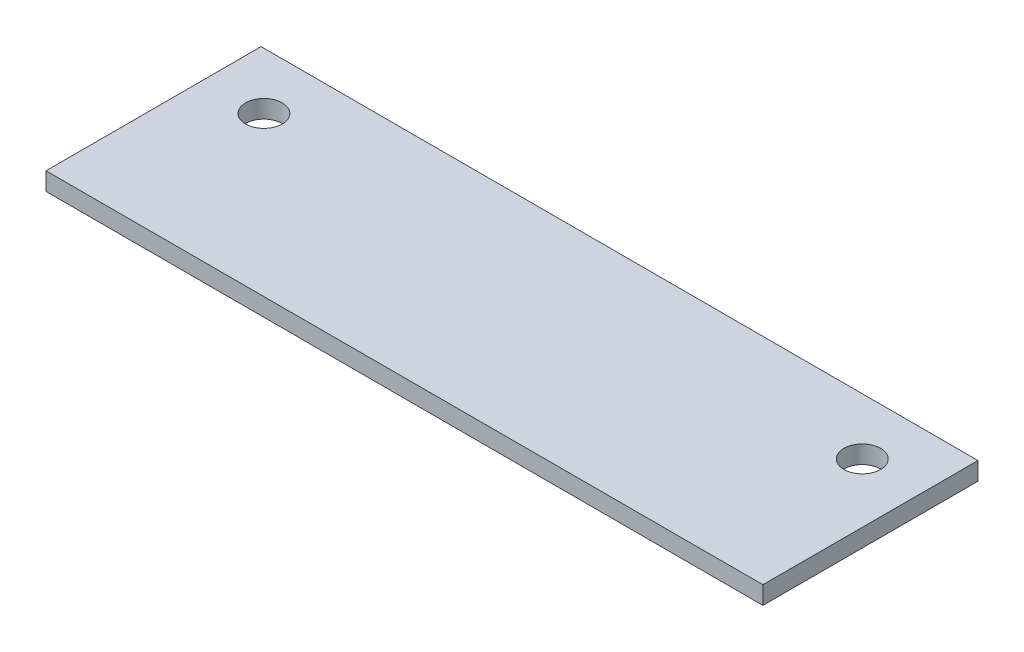
ISO-10303-21;
HEADER;
FILE_DESCRIPTION(('STEP AP214'),'2;1');
FILE_NAME('part.step','',(''),(''),'','','');
FILE_SCHEMA(('AUTOMOTIVE_DESIGN { 1 0 10303 214 1 1 1 1 }'));
ENDSEC;
DATA;
#1=APPLICATION_CONTEXT('core data for automotive mechanical design processes');
#2=APPLICATION_PROTOCOL_DEFINITION('international standard','automotive_design',2000,#1);
#3=PRODUCT_CONTEXT('',#1,'mechanical');
#4=PRODUCT('Part','Part','',(#3));
#5=PRODUCT_RELATED_PRODUCT_CATEGORY('part','',(#4));
#6=PRODUCT_DEFINITION_FORMATION('','',#4);
#7=PRODUCT_DEFINITION_CONTEXT('part definition',#1,'design');
#8=PRODUCT_DEFINITION('design','',#6,#7);
#9=PRODUCT_DEFINITION_SHAPE('','',#8);
#10=(LENGTH_UNIT() NAMED_UNIT(*) SI_UNIT(.MILLI.,.METRE.));
#11=(NAMED_UNIT(*) PLANE_ANGLE_UNIT() SI_UNIT($,.RADIAN.));
#12=(NAMED_UNIT(*) SI_UNIT($,.STERADIAN.) SOLID_ANGLE_UNIT());
#13=UNCERTAINTY_MEASURE_WITH_UNIT(LENGTH_MEASURE(1.E-05),#10,'distance_accuracy_value','');
#14=(GEOMETRIC_REPRESENTATION_CONTEXT(3) GLOBAL_UNCERTAINTY_ASSIGNED_CONTEXT((#13)) GLOBAL_UNIT_ASSIGNED_CONTEXT((#10,
#11,#12)) REPRESENTATION_CONTEXT('',''));
#15=CARTESIAN_POINT('',(0.,0.,0.));
#16=DIRECTION('',(0.,0.,1.));
#17=DIRECTION('',(1.,0.,0.));
#18=AXIS2_PLACEMENT_3D('',#15,#16,#17);
#19=CARTESIAN_POINT('',(-63.5,3.175,38.1));
#20=DIRECTION('',(-1.,0.,0.));
#21=DIRECTION('',(0.,0.,1.));
#22=AXIS2_PLACEMENT_3D('',#19,#20,#21);
#23=PLANE('',#22);
#24=DIRECTION('',(0.,1.,0.));
#25=VECTOR('',#24,1.);
#26=CARTESIAN_POINT('',(-63.5,0.,0.));
#27=LINE('',#26,#25);
#28=CARTESIAN_POINT('',(-63.5,0.,0.));
#29=VERTEX_POINT('',#28);
#30=CARTESIAN_POINT('',(-63.5,3.175,0.));
#31=VERTEX_POINT('',#30);
#32=EDGE_CURVE('E47',#29,#31,#27,.T.);
#33=ORIENTED_EDGE('',*,*,#32,.T.);
#34=DIRECTION('',(0.,0.,-1.));
#35=VECTOR('',#34,1.);
#36=CARTESIAN_POINT('',(-63.5,3.175,38.1));
#37=LINE('',#36,#35);
#38=CARTESIAN_POINT('',(-63.5,3.175,-38.1));
#39=VERTEX_POINT('',#38);
#40=EDGE_CURVE('E77',#31,#39,#37,.T.);
#41=ORIENTED_EDGE('',*,*,#40,.T.);
#42=DIRECTION('',(0.,-1.,0.));
#43=VECTOR('',#42,1.);
#44=CARTESIAN_POINT('',(-63.5,3.175,-38.1));
#45=LINE('',#44,#43);
#46=CARTESIAN_POINT('',(-63.5,0.,-38.1));
#47=VERTEX_POINT('',#46);
#48=EDGE_CURVE('E36',#39,#47,#45,.T.);
#49=ORIENTED_EDGE('',*,*,#48,.T.);
#50=DIRECTION('',(0.,0.,-1.));
#51=VECTOR('',#50,1.);
#52=CARTESIAN_POINT('',(-63.5,0.,38.1));
#53=LINE('',#52,#51);
#54=EDGE_CURVE('E88',#29,#47,#53,.T.);
#55=ORIENTED_EDGE('',*,*,#54,.F.);
#56=EDGE_LOOP('',(#33,#41,#49,#55));
#57=FACE_BOUND('',#56,.T.);
#58=ADVANCED_FACE('F33',(#57),#23,.T.);
#59=CARTESIAN_POINT('',(63.5,3.175,38.1));
#60=DIRECTION('',(-1.,0.,0.));
#61=DIRECTION('',(0.,0.,1.));
#62=AXIS2_PLACEMENT_3D('',#59,#60,#61);
#63=PLANE('',#62);
#64=DIRECTION('',(0.,0.,-1.));
#65=VECTOR('',#64,1.);
#66=CARTESIAN_POINT('',(63.5,3.175,38.1));
#67=LINE('',#66,#65);
#68=CARTESIAN_POINT('',(63.5,3.175,0.));
#69=VERTEX_POINT('',#68);
#70=CARTESIAN_POINT('',(63.5,3.175,-38.1));
#71=VERTEX_POINT('',#70);
#72=EDGE_CURVE('E56',#69,#71,#67,.T.);
#73=ORIENTED_EDGE('',*,*,#72,.F.);
#74=DIRECTION('',(0.,1.,0.));
#75=VECTOR('',#74,1.);
#76=CARTESIAN_POINT('',(63.5,0.,0.));
#77=LINE('',#76,#75);
#78=CARTESIAN_POINT('',(63.5,0.,0.));
#79=VERTEX_POINT('',#78);
#80=EDGE_CURVE('E74',#79,#69,#77,.T.);
#81=ORIENTED_EDGE('',*,*,#80,.F.);
#82=DIRECTION('',(0.,0.,-1.));
#83=VECTOR('',#82,1.);
#84=CARTESIAN_POINT('',(63.5,0.,38.1));
#85=LINE('',#84,#83);
#86=CARTESIAN_POINT('',(63.5,0.,-38.1));
#87=VERTEX_POINT('',#86);
#88=EDGE_CURVE('E70',#79,#87,#85,.T.);
#89=ORIENTED_EDGE('',*,*,#88,.T.);
#90=DIRECTION('',(0.,-1.,0.));
#91=VECTOR('',#90,1.);
#92=CARTESIAN_POINT('',(63.5,3.175,-38.1));
#93=LINE('',#92,#91);
#94=EDGE_CURVE('E11',#71,#87,#93,.T.);
#95=ORIENTED_EDGE('',*,*,#94,.F.);
#96=EDGE_LOOP('',(#73,#81,#89,#95));
#97=FACE_BOUND('',#96,.T.);
#98=ADVANCED_FACE('F71',(#97),#63,.F.);
#99=CARTESIAN_POINT('',(-63.5,3.175,-38.1));
#100=DIRECTION('',(0.,0.,-1.));
#101=DIRECTION('',(-1.,0.,0.));
#102=AXIS2_PLACEMENT_3D('',#99,#100,#101);
#103=PLANE('',#102);
#104=DIRECTION('',(1.,0.,0.));
#105=VECTOR('',#104,1.);
#106=CARTESIAN_POINT('',(-63.5,0.,-38.1));
#107=LINE('',#106,#105);
#108=EDGE_CURVE('E78',#47,#87,#107,.T.);
#109=ORIENTED_EDGE('',*,*,#108,.F.);
#110=ORIENTED_EDGE('',*,*,#48,.F.);
#111=DIRECTION('',(1.,0.,0.));
#112=VECTOR('',#111,1.);
#113=CARTESIAN_POINT('',(-63.5,3.175,-38.1));
#114=LINE('',#113,#112);
#115=EDGE_CURVE('E84',#39,#71,#114,.T.);
#116=ORIENTED_EDGE('',*,*,#115,.T.);
#117=ORIENTED_EDGE('',*,*,#94,.T.);
#118=EDGE_LOOP('',(#109,#110,#116,#117));
#119=FACE_BOUND('',#118,.T.);
#120=ADVANCED_FACE('F82',(#119),#103,.T.);
#121=CARTESIAN_POINT('',(0.,3.175,0.));
#122=DIRECTION('',(0.,-1.,0.));
#123=DIRECTION('',(0.,0.,-1.));
#124=AXIS2_PLACEMENT_3D('',#121,#122,#123);
#125=PLANE('',#124);
#126=CARTESIAN_POINT('',(-53.,3.175,-28.1));
#127=DIRECTION('',(0.,1.,0.));
#128=DIRECTION('',(0.,0.,1.));
#129=AXIS2_PLACEMENT_3D('',#126,#127,#128);
#130=CIRCLE('',#129,3.24999999999995);
#131=CARTESIAN_POINT('',(-53.,3.175,-24.85));
#132=VERTEX_POINT('',#131);
#133=EDGE_CURVE('E102',#132,#132,#130,.T.);
#134=ORIENTED_EDGE('',*,*,#133,.F.);
#135=EDGE_LOOP('',(#134));
#136=FACE_BOUND('',#135,.T.);
#137=CARTESIAN_POINT('',(53.0000000000001,3.175,-28.1));
#138=DIRECTION('',(0.,1.,0.));
#139=DIRECTION('',(0.,0.,1.));
#140=AXIS2_PLACEMENT_3D('',#137,#138,#139);
#141=CIRCLE('',#140,3.24999999999995);
#142=CARTESIAN_POINT('',(53.0000000000001,3.175,-24.85));
#143=VERTEX_POINT('',#142);
#144=EDGE_CURVE('E96',#143,#143,#141,.T.);
#145=ORIENTED_EDGE('',*,*,#144,.F.);
#146=EDGE_LOOP('',(#145));
#147=FACE_BOUND('',#146,.T.);
#148=ORIENTED_EDGE('',*,*,#40,.F.);
#149=DIRECTION('',(-1.,0.,0.));
#150=VECTOR('',#149,1.);
#151=CARTESIAN_POINT('',(0.,3.175,0.));
#152=LINE('',#151,#150);
#153=EDGE_CURVE('E108',#69,#31,#152,.T.);
#154=ORIENTED_EDGE('',*,*,#153,.F.);
#155=ORIENTED_EDGE('',*,*,#72,.T.);
#156=ORIENTED_EDGE('',*,*,#115,.F.);
#157=EDGE_LOOP('',(#148,#154,#155,#156));
#158=FACE_BOUND('',#157,.T.);
#159=ADVANCED_FACE('F116',(#136,#147,#158),#125,.F.);
#160=CARTESIAN_POINT('',(0.,0.,0.));
#161=DIRECTION('',(0.,-1.,0.));
#162=DIRECTION('',(0.,0.,-1.));
#163=AXIS2_PLACEMENT_3D('',#160,#161,#162);
#164=PLANE('',#163);
#165=DIRECTION('',(-1.,0.,0.));
#166=VECTOR('',#165,1.);
#167=CARTESIAN_POINT('',(0.,0.,0.));
#168=LINE('',#167,#166);
#169=EDGE_CURVE('E110',#79,#29,#168,.T.);
#170=ORIENTED_EDGE('',*,*,#169,.T.);
#171=ORIENTED_EDGE('',*,*,#54,.T.);
#172=ORIENTED_EDGE('',*,*,#108,.T.);
#173=ORIENTED_EDGE('',*,*,#88,.F.);
#174=EDGE_LOOP('',(#170,#171,#172,#173));
#175=FACE_BOUND('',#174,.T.);
#176=CARTESIAN_POINT('',(-53.,0.,-28.1));
#177=DIRECTION('',(0.,1.,0.));
#178=DIRECTION('',(0.,0.,1.));
#179=AXIS2_PLACEMENT_3D('',#176,#177,#178);
#180=CIRCLE('',#179,3.24999999999995);
#181=CARTESIAN_POINT('',(-53.,0.,-24.85));
#182=VERTEX_POINT('',#181);
#183=EDGE_CURVE('E105',#182,#182,#180,.T.);
#184=ORIENTED_EDGE('',*,*,#183,.T.);
#185=EDGE_LOOP('',(#184));
#186=FACE_BOUND('',#185,.T.);
#187=CARTESIAN_POINT('',(53.0000000000001,0.,-28.1));
#188=DIRECTION('',(0.,1.,0.));
#189=DIRECTION('',(0.,0.,1.));
#190=AXIS2_PLACEMENT_3D('',#187,#188,#189);
#191=CIRCLE('',#190,3.24999999999995);
#192=CARTESIAN_POINT('',(53.0000000000001,0.,-24.85));
#193=VERTEX_POINT('',#192);
#194=EDGE_CURVE('E99',#193,#193,#191,.T.);
#195=ORIENTED_EDGE('',*,*,#194,.T.);
#196=EDGE_LOOP('',(#195));
#197=FACE_BOUND('',#196,.T.);
#198=ADVANCED_FACE('F85',(#175,#186,#197),#164,.T.);
#199=CARTESIAN_POINT('',(53.0000000000001,0.,-28.1));
#200=DIRECTION('',(0.,1.,0.));
#201=DIRECTION('',(0.,0.,1.));
#202=AXIS2_PLACEMENT_3D('',#199,#200,#201);
#203=CYLINDRICAL_SURFACE('',#202,3.24999999999995);
#204=ORIENTED_EDGE('',*,*,#194,.F.);
#205=EDGE_LOOP('',(#204));
#206=FACE_BOUND('',#205,.T.);
#207=ORIENTED_EDGE('',*,*,#144,.T.);
#208=EDGE_LOOP('',(#207));
#209=FACE_BOUND('',#208,.T.);
#210=ADVANCED_FACE('F127',(#206,#209),#203,.F.);
#211=CARTESIAN_POINT('',(-53.,0.,-28.1));
#212=DIRECTION('',(0.,1.,0.));
#213=DIRECTION('',(0.,0.,1.));
#214=AXIS2_PLACEMENT_3D('',#211,#212,#213);
#215=CYLINDRICAL_SURFACE('',#214,3.24999999999995);
#216=ORIENTED_EDGE('',*,*,#183,.F.);
#217=EDGE_LOOP('',(#216));
#218=FACE_BOUND('',#217,.T.);
#219=ORIENTED_EDGE('',*,*,#133,.T.);
#220=EDGE_LOOP('',(#219));
#221=FACE_BOUND('',#220,.T.);
#222=ADVANCED_FACE('F122',(#218,#221),#215,.F.);
#223=CARTESIAN_POINT('',(0.,0.,0.));
#224=DIRECTION('',(0.,0.,-1.));
#225=DIRECTION('',(-1.,0.,0.));
#226=AXIS2_PLACEMENT_3D('',#223,#224,#225);
#227=PLANE('',#226);
#228=ORIENTED_EDGE('',*,*,#153,.T.);
#229=ORIENTED_EDGE('',*,*,#32,.F.);
#230=ORIENTED_EDGE('',*,*,#169,.F.);
#231=ORIENTED_EDGE('',*,*,#80,.T.);
#232=EDGE_LOOP('',(#228,#229,#230,#231));
#233=FACE_BOUND('',#232,.T.);
#234=ADVANCED_FACE('F120',(#233),#227,.F.);
#235=CLOSED_SHELL('',(#58,#98,#120,#159,#198,#210,#222,#234));
#236=MANIFOLD_SOLID_BREP('B2',#235);
#237=ADVANCED_BREP_SHAPE_REPRESENTATION('',(#18,#236),#14);
#238=SHAPE_DEFINITION_REPRESENTATION(#9,#237);
ENDSEC;
END-ISO-10303-21;
